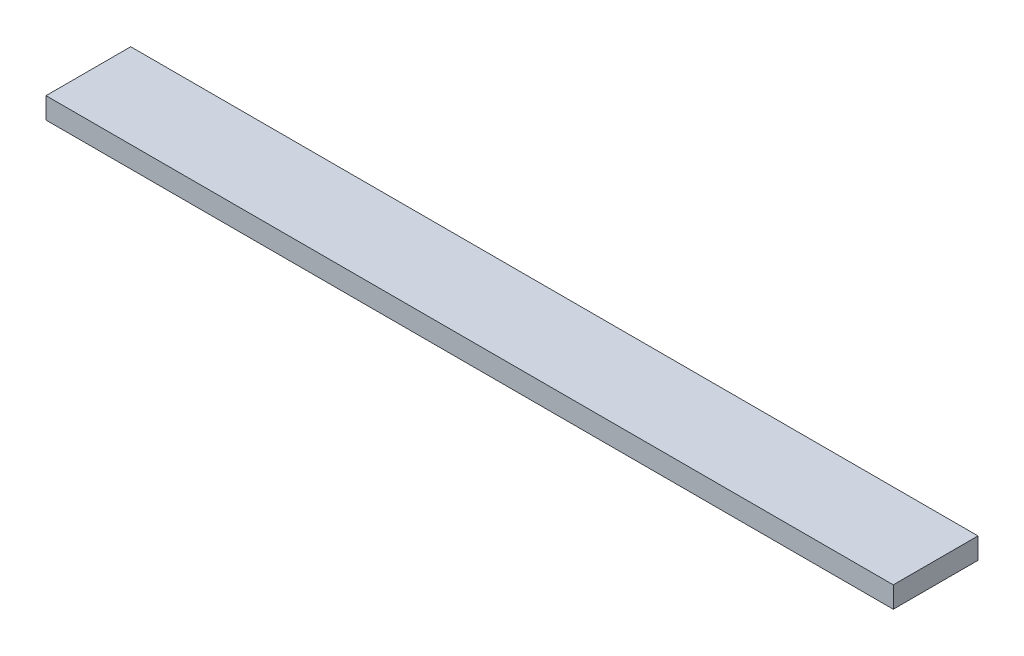
ISO-10303-21;
HEADER;
FILE_DESCRIPTION(('STEP AP214'),'2;1');
FILE_NAME('part.step','',(''),(''),'','','');
FILE_SCHEMA(('AUTOMOTIVE_DESIGN { 1 0 10303 214 1 1 1 1 }'));
ENDSEC;
DATA;
#1=APPLICATION_CONTEXT('core data for automotive mechanical design processes');
#2=APPLICATION_PROTOCOL_DEFINITION('international standard','automotive_design',2000,#1);
#3=PRODUCT_CONTEXT('',#1,'mechanical');
#4=PRODUCT('Part','Part','',(#3));
#5=PRODUCT_RELATED_PRODUCT_CATEGORY('part','',(#4));
#6=PRODUCT_DEFINITION_FORMATION('','',#4);
#7=PRODUCT_DEFINITION_CONTEXT('part definition',#1,'design');
#8=PRODUCT_DEFINITION('design','',#6,#7);
#9=PRODUCT_DEFINITION_SHAPE('','',#8);
#10=(LENGTH_UNIT() NAMED_UNIT(*) SI_UNIT(.MILLI.,.METRE.));
#11=(NAMED_UNIT(*) PLANE_ANGLE_UNIT() SI_UNIT($,.RADIAN.));
#12=(NAMED_UNIT(*) SI_UNIT($,.STERADIAN.) SOLID_ANGLE_UNIT());
#13=UNCERTAINTY_MEASURE_WITH_UNIT(LENGTH_MEASURE(1.E-05),#10,'distance_accuracy_value','');
#14=(GEOMETRIC_REPRESENTATION_CONTEXT(3) GLOBAL_UNCERTAINTY_ASSIGNED_CONTEXT((#13)) GLOBAL_UNIT_ASSIGNED_CONTEXT((#10,
#11,#12)) REPRESENTATION_CONTEXT('',''));
#15=CARTESIAN_POINT('',(0.,0.,0.));
#16=DIRECTION('',(0.,0.,1.));
#17=DIRECTION('',(1.,0.,0.));
#18=AXIS2_PLACEMENT_3D('',#15,#16,#17);
#19=CARTESIAN_POINT('',(-40.,-2.,4.));
#20=DIRECTION('',(0.,0.,1.));
#21=DIRECTION('',(1.,0.,0.));
#22=AXIS2_PLACEMENT_3D('',#19,#20,#21);
#23=PLANE('',#22);
#24=DIRECTION('',(1.,0.,0.));
#25=VECTOR('',#24,1.);
#26=CARTESIAN_POINT('',(-40.,-2.,4.));
#27=LINE('',#26,#25);
#28=CARTESIAN_POINT('',(-40.,-2.,4.));
#29=VERTEX_POINT('',#28);
#30=CARTESIAN_POINT('',(40.,-2.,4.));
#31=VERTEX_POINT('',#30);
#32=EDGE_CURVE('E95',#29,#31,#27,.T.);
#33=ORIENTED_EDGE('',*,*,#32,.T.);
#34=DIRECTION('',(0.,-1.,0.));
#35=VECTOR('',#34,1.);
#36=CARTESIAN_POINT('',(40.,-2.,4.));
#37=LINE('',#36,#35);
#38=CARTESIAN_POINT('',(40.,0.,4.));
#39=VERTEX_POINT('',#38);
#40=EDGE_CURVE('E103',#39,#31,#37,.T.);
#41=ORIENTED_EDGE('',*,*,#40,.F.);
#42=DIRECTION('',(1.,0.,0.));
#43=VECTOR('',#42,1.);
#44=CARTESIAN_POINT('',(-40.,0.,4.));
#45=LINE('',#44,#43);
#46=CARTESIAN_POINT('',(-40.,0.,4.));
#47=VERTEX_POINT('',#46);
#48=EDGE_CURVE('E122',#47,#39,#45,.T.);
#49=ORIENTED_EDGE('',*,*,#48,.F.);
#50=DIRECTION('',(0.,-1.,0.));
#51=VECTOR('',#50,1.);
#52=CARTESIAN_POINT('',(-40.,-2.,4.));
#53=LINE('',#52,#51);
#54=EDGE_CURVE('E105',#47,#29,#53,.T.);
#55=ORIENTED_EDGE('',*,*,#54,.T.);
#56=EDGE_LOOP('',(#33,#41,#49,#55));
#57=FACE_BOUND('',#56,.T.);
#58=ADVANCED_FACE('F40',(#57),#23,.T.);
#59=CARTESIAN_POINT('',(-40.,0.,4.));
#60=DIRECTION('',(0.,1.,0.));
#61=DIRECTION('',(0.,0.,1.));
#62=AXIS2_PLACEMENT_3D('',#59,#60,#61);
#63=PLANE('',#62);
#64=ORIENTED_EDGE('',*,*,#48,.T.);
#65=DIRECTION('',(0.,0.,1.));
#66=VECTOR('',#65,1.);
#67=CARTESIAN_POINT('',(40.,0.,4.));
#68=LINE('',#67,#66);
#69=CARTESIAN_POINT('',(40.,0.,-4.));
#70=VERTEX_POINT('',#69);
#71=EDGE_CURVE('E116',#70,#39,#68,.T.);
#72=ORIENTED_EDGE('',*,*,#71,.F.);
#73=DIRECTION('',(1.,0.,0.));
#74=VECTOR('',#73,1.);
#75=CARTESIAN_POINT('',(-40.,0.,-4.));
#76=LINE('',#75,#74);
#77=CARTESIAN_POINT('',(-40.,0.,-4.));
#78=VERTEX_POINT('',#77);
#79=EDGE_CURVE('E125',#78,#70,#76,.T.);
#80=ORIENTED_EDGE('',*,*,#79,.F.);
#81=DIRECTION('',(0.,0.,1.));
#82=VECTOR('',#81,1.);
#83=CARTESIAN_POINT('',(-40.,0.,4.));
#84=LINE('',#83,#82);
#85=EDGE_CURVE('E106',#78,#47,#84,.T.);
#86=ORIENTED_EDGE('',*,*,#85,.T.);
#87=EDGE_LOOP('',(#64,#72,#80,#86));
#88=FACE_BOUND('',#87,.T.);
#89=ADVANCED_FACE('F157',(#88),#63,.T.);
#90=CARTESIAN_POINT('',(-40.,0.,-4.));
#91=DIRECTION('',(0.,0.,-1.));
#92=DIRECTION('',(-1.,0.,0.));
#93=AXIS2_PLACEMENT_3D('',#90,#91,#92);
#94=PLANE('',#93);
#95=ORIENTED_EDGE('',*,*,#79,.T.);
#96=DIRECTION('',(0.,1.,0.));
#97=VECTOR('',#96,1.);
#98=CARTESIAN_POINT('',(40.,0.,-4.));
#99=LINE('',#98,#97);
#100=CARTESIAN_POINT('',(40.,-2.,-4.));
#101=VERTEX_POINT('',#100);
#102=EDGE_CURVE('E117',#101,#70,#99,.T.);
#103=ORIENTED_EDGE('',*,*,#102,.F.);
#104=DIRECTION('',(1.,0.,0.));
#105=VECTOR('',#104,1.);
#106=CARTESIAN_POINT('',(-40.,-2.,-4.));
#107=LINE('',#106,#105);
#108=CARTESIAN_POINT('',(-40.,-2.,-4.));
#109=VERTEX_POINT('',#108);
#110=EDGE_CURVE('E142',#109,#101,#107,.T.);
#111=ORIENTED_EDGE('',*,*,#110,.F.);
#112=DIRECTION('',(0.,1.,0.));
#113=VECTOR('',#112,1.);
#114=CARTESIAN_POINT('',(-40.,0.,-4.));
#115=LINE('',#114,#113);
#116=EDGE_CURVE('E149',#109,#78,#115,.T.);
#117=ORIENTED_EDGE('',*,*,#116,.T.);
#118=EDGE_LOOP('',(#95,#103,#111,#117));
#119=FACE_BOUND('',#118,.T.);
#120=ADVANCED_FACE('F173',(#119),#94,.T.);
#121=CARTESIAN_POINT('',(-40.,-2.,-4.));
#122=DIRECTION('',(0.,-0.707106781186548,-0.707106781186547));
#123=DIRECTION('',(0.,0.707106781186547,-0.707106781186548));
#124=AXIS2_PLACEMENT_3D('',#121,#122,#123);
#125=PLANE('',#124);
#126=ORIENTED_EDGE('',*,*,#110,.T.);
#127=DIRECTION('',(-0.57735026918963,-0.577350269189624,0.577350269189624));
#128=VECTOR('',#127,1.);
#129=CARTESIAN_POINT('',(13.333333333333,-28.6666666666667,22.6666666666668));
#130=LINE('',#129,#128);
#131=CARTESIAN_POINT('',(38.5,-3.5,-2.5));
#132=VERTEX_POINT('',#131);
#133=EDGE_CURVE('E120',#101,#132,#130,.T.);
#134=ORIENTED_EDGE('',*,*,#133,.T.);
#135=DIRECTION('',(1.,0.,0.));
#136=VECTOR('',#135,1.);
#137=CARTESIAN_POINT('',(-40.,-3.5,-2.5));
#138=LINE('',#137,#136);
#139=CARTESIAN_POINT('',(-38.5,-3.5,-2.5));
#140=VERTEX_POINT('',#139);
#141=EDGE_CURVE('E137',#140,#132,#138,.T.);
#142=ORIENTED_EDGE('',*,*,#141,.F.);
#143=DIRECTION('',(0.577350269189624,-0.577350269189627,0.577350269189627));
#144=VECTOR('',#143,1.);
#145=CARTESIAN_POINT('',(-40.,-2.,-4.));
#146=LINE('',#145,#144);
#147=EDGE_CURVE('E121',#140,#109,#146,.F.);
#148=ORIENTED_EDGE('',*,*,#147,.T.);
#149=EDGE_LOOP('',(#126,#134,#142,#148));
#150=FACE_BOUND('',#149,.T.);
#151=ADVANCED_FACE('F140',(#150),#125,.T.);
#152=CARTESIAN_POINT('',(-40.,-3.5,-2.5));
#153=DIRECTION('',(0.,-1.,0.));
#154=DIRECTION('',(0.,0.,-1.));
#155=AXIS2_PLACEMENT_3D('',#152,#153,#154);
#156=PLANE('',#155);
#157=ORIENTED_EDGE('',*,*,#141,.T.);
#158=DIRECTION('',(0.,0.,1.));
#159=VECTOR('',#158,1.);
#160=CARTESIAN_POINT('',(38.5,-3.5,2.5));
#161=LINE('',#160,#159);
#162=CARTESIAN_POINT('',(38.5,-3.5,2.5));
#163=VERTEX_POINT('',#162);
#164=EDGE_CURVE('E56',#132,#163,#161,.T.);
#165=ORIENTED_EDGE('',*,*,#164,.T.);
#166=DIRECTION('',(1.,0.,0.));
#167=VECTOR('',#166,1.);
#168=CARTESIAN_POINT('',(-40.,-3.5,2.5));
#169=LINE('',#168,#167);
#170=CARTESIAN_POINT('',(-38.5,-3.5,2.5));
#171=VERTEX_POINT('',#170);
#172=EDGE_CURVE('E97',#171,#163,#169,.T.);
#173=ORIENTED_EDGE('',*,*,#172,.F.);
#174=DIRECTION('',(0.,0.,-1.));
#175=VECTOR('',#174,1.);
#176=CARTESIAN_POINT('',(-38.5,-3.5,-2.5));
#177=LINE('',#176,#175);
#178=EDGE_CURVE('E130',#171,#140,#177,.T.);
#179=ORIENTED_EDGE('',*,*,#178,.T.);
#180=EDGE_LOOP('',(#157,#165,#173,#179));
#181=FACE_BOUND('',#180,.T.);
#182=ADVANCED_FACE('F136',(#181),#156,.T.);
#183=CARTESIAN_POINT('',(-40.,-3.5,2.5));
#184=DIRECTION('',(0.,-0.707106781186548,0.707106781186547));
#185=DIRECTION('',(0.,-0.707106781186547,-0.707106781186548));
#186=AXIS2_PLACEMENT_3D('',#183,#184,#185);
#187=PLANE('',#186);
#188=ORIENTED_EDGE('',*,*,#172,.T.);
#189=DIRECTION('',(0.57735026918963,0.577350269189624,0.577350269189624));
#190=VECTOR('',#189,1.);
#191=CARTESIAN_POINT('',(12.333333333333,-29.6666666666667,-23.6666666666668));
#192=LINE('',#191,#190);
#193=EDGE_CURVE('E49',#163,#31,#192,.T.);
#194=ORIENTED_EDGE('',*,*,#193,.T.);
#195=ORIENTED_EDGE('',*,*,#32,.F.);
#196=DIRECTION('',(-0.577350269189624,0.577350269189627,0.577350269189627));
#197=VECTOR('',#196,1.);
#198=CARTESIAN_POINT('',(-39.,-3.,3.));
#199=LINE('',#198,#197);
#200=EDGE_CURVE('E63',#29,#171,#199,.F.);
#201=ORIENTED_EDGE('',*,*,#200,.T.);
#202=EDGE_LOOP('',(#188,#194,#195,#201));
#203=FACE_BOUND('',#202,.T.);
#204=ADVANCED_FACE('F94',(#203),#187,.T.);
#205=CARTESIAN_POINT('',(-40.,0.,0.));
#206=DIRECTION('',(-1.,0.,0.));
#207=DIRECTION('',(0.,0.,1.));
#208=AXIS2_PLACEMENT_3D('',#205,#206,#207);
#209=PLANE('',#208);
#210=ORIENTED_EDGE('',*,*,#116,.F.);
#211=DIRECTION('',(0.,0.,1.));
#212=VECTOR('',#211,1.);
#213=CARTESIAN_POINT('',(-40.,-1.99999999999999,0.));
#214=LINE('',#213,#212);
#215=EDGE_CURVE('E11',#109,#29,#214,.T.);
#216=ORIENTED_EDGE('',*,*,#215,.T.);
#217=ORIENTED_EDGE('',*,*,#54,.F.);
#218=ORIENTED_EDGE('',*,*,#85,.F.);
#219=EDGE_LOOP('',(#210,#216,#217,#218));
#220=FACE_BOUND('',#219,.T.);
#221=ADVANCED_FACE('F161',(#220),#209,.T.);
#222=CARTESIAN_POINT('',(40.,0.,0.));
#223=DIRECTION('',(-1.,0.,0.));
#224=DIRECTION('',(0.,0.,1.));
#225=AXIS2_PLACEMENT_3D('',#222,#223,#224);
#226=PLANE('',#225);
#227=ORIENTED_EDGE('',*,*,#40,.T.);
#228=DIRECTION('',(0.,0.,-1.));
#229=VECTOR('',#228,1.);
#230=CARTESIAN_POINT('',(40.,-2.,-2.5));
#231=LINE('',#230,#229);
#232=EDGE_CURVE('E113',#31,#101,#231,.T.);
#233=ORIENTED_EDGE('',*,*,#232,.T.);
#234=ORIENTED_EDGE('',*,*,#102,.T.);
#235=ORIENTED_EDGE('',*,*,#71,.T.);
#236=EDGE_LOOP('',(#227,#233,#234,#235));
#237=FACE_BOUND('',#236,.T.);
#238=ADVANCED_FACE('F111',(#237),#226,.F.);
#239=CARTESIAN_POINT('',(40.,-2.,0.));
#240=DIRECTION('',(0.707106781186544,-0.707106781186551,0.));
#241=DIRECTION('',(0.,0.,1.));
#242=AXIS2_PLACEMENT_3D('',#239,#240,#241);
#243=PLANE('',#242);
#244=ORIENTED_EDGE('',*,*,#193,.F.);
#245=ORIENTED_EDGE('',*,*,#164,.F.);
#246=ORIENTED_EDGE('',*,*,#133,.F.);
#247=ORIENTED_EDGE('',*,*,#232,.F.);
#248=EDGE_LOOP('',(#244,#245,#246,#247));
#249=FACE_BOUND('',#248,.T.);
#250=ADVANCED_FACE('F119',(#249),#243,.T.);
#251=CARTESIAN_POINT('',(-38.5,-3.5,-2.5));
#252=DIRECTION('',(0.707106781186549,0.707106781186546,0.));
#253=DIRECTION('',(0.,0.,-1.));
#254=AXIS2_PLACEMENT_3D('',#251,#252,#253);
#255=PLANE('',#254);
#256=ORIENTED_EDGE('',*,*,#200,.F.);
#257=ORIENTED_EDGE('',*,*,#215,.F.);
#258=ORIENTED_EDGE('',*,*,#147,.F.);
#259=ORIENTED_EDGE('',*,*,#178,.F.);
#260=EDGE_LOOP('',(#256,#257,#258,#259));
#261=FACE_BOUND('',#260,.T.);
#262=ADVANCED_FACE('F43',(#261),#255,.F.);
#263=CLOSED_SHELL('',(#58,#89,#120,#151,#182,#204,#221,#238,#250,#262));
#264=MANIFOLD_SOLID_BREP('B2',#263);
#265=ADVANCED_BREP_SHAPE_REPRESENTATION('',(#18,#264),#14);
#266=SHAPE_DEFINITION_REPRESENTATION(#9,#265);
ENDSEC;
END-ISO-10303-21;
